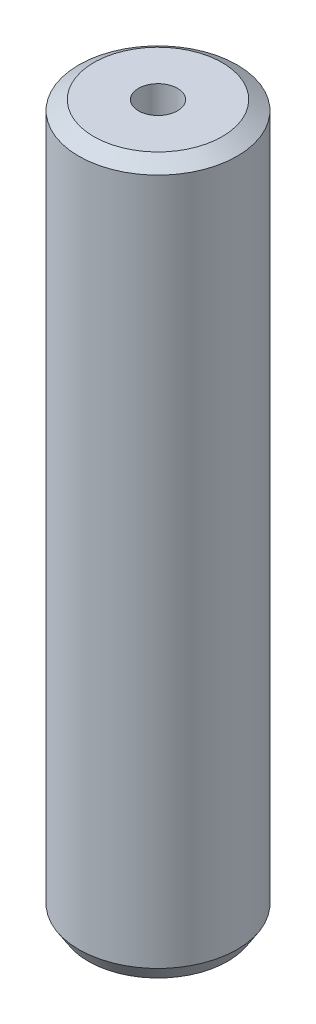
ISO-10303-21;
HEADER;
FILE_DESCRIPTION(('STEP AP214'),'2;1');
FILE_NAME('part.step','',(''),(''),'','','');
FILE_SCHEMA(('AUTOMOTIVE_DESIGN { 1 0 10303 214 1 1 1 1 }'));
ENDSEC;
DATA;
#1=APPLICATION_CONTEXT('core data for automotive mechanical design processes');
#2=APPLICATION_PROTOCOL_DEFINITION('international standard','automotive_design',2000,#1);
#3=PRODUCT_CONTEXT('',#1,'mechanical');
#4=PRODUCT('Part','Part','',(#3));
#5=PRODUCT_RELATED_PRODUCT_CATEGORY('part','',(#4));
#6=PRODUCT_DEFINITION_FORMATION('','',#4);
#7=PRODUCT_DEFINITION_CONTEXT('part definition',#1,'design');
#8=PRODUCT_DEFINITION('design','',#6,#7);
#9=PRODUCT_DEFINITION_SHAPE('','',#8);
#10=(LENGTH_UNIT() NAMED_UNIT(*) SI_UNIT(.MILLI.,.METRE.));
#11=(NAMED_UNIT(*) PLANE_ANGLE_UNIT() SI_UNIT($,.RADIAN.));
#12=(NAMED_UNIT(*) SI_UNIT($,.STERADIAN.) SOLID_ANGLE_UNIT());
#13=UNCERTAINTY_MEASURE_WITH_UNIT(LENGTH_MEASURE(1.E-05),#10,'distance_accuracy_value','');
#14=(GEOMETRIC_REPRESENTATION_CONTEXT(3) GLOBAL_UNCERTAINTY_ASSIGNED_CONTEXT((#13)) GLOBAL_UNIT_ASSIGNED_CONTEXT((#10,
#11,#12)) REPRESENTATION_CONTEXT('',''));
#15=CARTESIAN_POINT('',(0.,0.,0.));
#16=DIRECTION('',(0.,0.,1.));
#17=DIRECTION('',(1.,0.,0.));
#18=AXIS2_PLACEMENT_3D('',#15,#16,#17);
#19=CARTESIAN_POINT('',(0.,67.4000229697129,0.));
#20=DIRECTION('',(0.,-1.,0.));
#21=DIRECTION('',(0.,0.,-1.));
#22=AXIS2_PLACEMENT_3D('',#19,#20,#21);
#23=CYLINDRICAL_SURFACE('',#22,7.5);
#24=CARTESIAN_POINT('',(0.,66.5026659646755,0.));
#25=DIRECTION('',(0.,1.,0.));
#26=DIRECTION('',(0.,0.,1.));
#27=AXIS2_PLACEMENT_3D('',#24,#25,#26);
#28=CIRCLE('',#27,7.5);
#29=CARTESIAN_POINT('',(0.,66.5026659646755,7.5));
#30=VERTEX_POINT('',#29);
#31=EDGE_CURVE('E50',#30,#30,#28,.F.);
#32=ORIENTED_EDGE('',*,*,#31,.T.);
#33=EDGE_LOOP('',(#32));
#34=FACE_BOUND('',#33,.T.);
#35=CARTESIAN_POINT('',(0.,1.42050366499207,0.));
#36=DIRECTION('',(0.,1.,0.));
#37=DIRECTION('',(0.,0.,1.));
#38=AXIS2_PLACEMENT_3D('',#35,#36,#37);
#39=CIRCLE('',#38,7.5);
#40=CARTESIAN_POINT('',(0.,1.42050366499207,7.5));
#41=VERTEX_POINT('',#40);
#42=EDGE_CURVE('E51',#41,#41,#39,.T.);
#43=ORIENTED_EDGE('',*,*,#42,.T.);
#44=EDGE_LOOP('',(#43));
#45=FACE_BOUND('',#44,.T.);
#46=ADVANCED_FACE('F39',(#34,#45),#23,.T.);
#47=CARTESIAN_POINT('',(0.,67.4000229697129,0.));
#48=DIRECTION('',(0.,1.,0.));
#49=DIRECTION('',(0.,0.,1.));
#50=AXIS2_PLACEMENT_3D('',#47,#48,#49);
#51=PLANE('',#50);
#52=CARTESIAN_POINT('',(0.,67.4000229697129,0.));
#53=DIRECTION('',(0.,1.,0.));
#54=DIRECTION('',(0.,0.,1.));
#55=AXIS2_PLACEMENT_3D('',#52,#53,#54);
#56=CIRCLE('',#55,6.07949633500791);
#57=CARTESIAN_POINT('',(0.,67.4000229697129,6.07949633500791));
#58=VERTEX_POINT('',#57);
#59=EDGE_CURVE('E54',#58,#58,#56,.T.);
#60=ORIENTED_EDGE('',*,*,#59,.T.);
#61=EDGE_LOOP('',(#60));
#62=FACE_BOUND('',#61,.T.);
#63=CARTESIAN_POINT('',(0.,67.4000229697129,0.));
#64=DIRECTION('',(0.,1.,0.));
#65=DIRECTION('',(0.,0.,1.));
#66=AXIS2_PLACEMENT_3D('',#63,#64,#65);
#67=CIRCLE('',#66,1.8496209034424);
#68=CARTESIAN_POINT('',(0.,67.4000229697129,1.8496209034424));
#69=VERTEX_POINT('',#68);
#70=EDGE_CURVE('E58',#69,#69,#67,.T.);
#71=ORIENTED_EDGE('',*,*,#70,.F.);
#72=EDGE_LOOP('',(#71));
#73=FACE_BOUND('',#72,.T.);
#74=ADVANCED_FACE('F69',(#62,#73),#51,.T.);
#75=CARTESIAN_POINT('',(0.,0.,0.));
#76=DIRECTION('',(0.,1.,0.));
#77=DIRECTION('',(0.,0.,1.));
#78=AXIS2_PLACEMENT_3D('',#75,#76,#77);
#79=PLANE('',#78);
#80=CARTESIAN_POINT('',(0.,0.,0.));
#81=DIRECTION('',(0.,1.,0.));
#82=DIRECTION('',(0.,0.,1.));
#83=AXIS2_PLACEMENT_3D('',#80,#81,#82);
#84=CIRCLE('',#83,6.60264299496264);
#85=CARTESIAN_POINT('',(0.,0.,6.60264299496264));
#86=VERTEX_POINT('',#85);
#87=EDGE_CURVE('E10',#86,#86,#84,.F.);
#88=ORIENTED_EDGE('',*,*,#87,.T.);
#89=EDGE_LOOP('',(#88));
#90=FACE_BOUND('',#89,.T.);
#91=CARTESIAN_POINT('',(0.,0.,0.));
#92=DIRECTION('',(0.,1.,0.));
#93=DIRECTION('',(0.,0.,1.));
#94=AXIS2_PLACEMENT_3D('',#91,#92,#93);
#95=CIRCLE('',#94,1.8496209034424);
#96=CARTESIAN_POINT('',(0.,0.,1.8496209034424));
#97=VERTEX_POINT('',#96);
#98=EDGE_CURVE('E63',#97,#97,#95,.T.);
#99=ORIENTED_EDGE('',*,*,#98,.T.);
#100=EDGE_LOOP('',(#99));
#101=FACE_BOUND('',#100,.T.);
#102=ADVANCED_FACE('F75',(#90,#101),#79,.F.);
#103=CARTESIAN_POINT('',(0.,67.4000229697129,0.));
#104=DIRECTION('',(0.,-1.,0.));
#105=DIRECTION('',(0.,0.,-1.));
#106=AXIS2_PLACEMENT_3D('',#103,#104,#105);
#107=CYLINDRICAL_SURFACE('',#106,1.8496209034424);
#108=ORIENTED_EDGE('',*,*,#70,.T.);
#109=EDGE_LOOP('',(#108));
#110=FACE_BOUND('',#109,.T.);
#111=ORIENTED_EDGE('',*,*,#98,.F.);
#112=EDGE_LOOP('',(#111));
#113=FACE_BOUND('',#112,.T.);
#114=ADVANCED_FACE('F70',(#110,#113),#107,.F.);
#115=CARTESIAN_POINT('',(0.,67.4000229697129,0.));
#116=DIRECTION('',(0.,-1.,0.));
#117=DIRECTION('',(0.,0.,-1.));
#118=AXIS2_PLACEMENT_3D('',#115,#116,#117);
#119=CONICAL_SURFACE('',#118,6.07949633500791,1.00738103648039);
#120=ORIENTED_EDGE('',*,*,#31,.F.);
#121=EDGE_LOOP('',(#120));
#122=FACE_BOUND('',#121,.T.);
#123=ORIENTED_EDGE('',*,*,#59,.F.);
#124=EDGE_LOOP('',(#123));
#125=FACE_BOUND('',#124,.T.);
#126=ADVANCED_FACE('F81',(#122,#125),#119,.T.);
#127=CARTESIAN_POINT('',(0.,1.42050366499207,0.));
#128=DIRECTION('',(0.,1.,0.));
#129=DIRECTION('',(0.,0.,1.));
#130=AXIS2_PLACEMENT_3D('',#127,#128,#129);
#131=CONICAL_SURFACE('',#130,7.5,0.563415290314504);
#132=ORIENTED_EDGE('',*,*,#87,.F.);
#133=EDGE_LOOP('',(#132));
#134=FACE_BOUND('',#133,.T.);
#135=ORIENTED_EDGE('',*,*,#42,.F.);
#136=EDGE_LOOP('',(#135));
#137=FACE_BOUND('',#136,.T.);
#138=ADVANCED_FACE('F45',(#134,#137),#131,.T.);
#139=CLOSED_SHELL('',(#46,#74,#102,#114,#126,#138));
#140=MANIFOLD_SOLID_BREP('B2',#139);
#141=ADVANCED_BREP_SHAPE_REPRESENTATION('',(#18,#140),#14);
#142=SHAPE_DEFINITION_REPRESENTATION(#9,#141);
ENDSEC;
END-ISO-10303-21;
